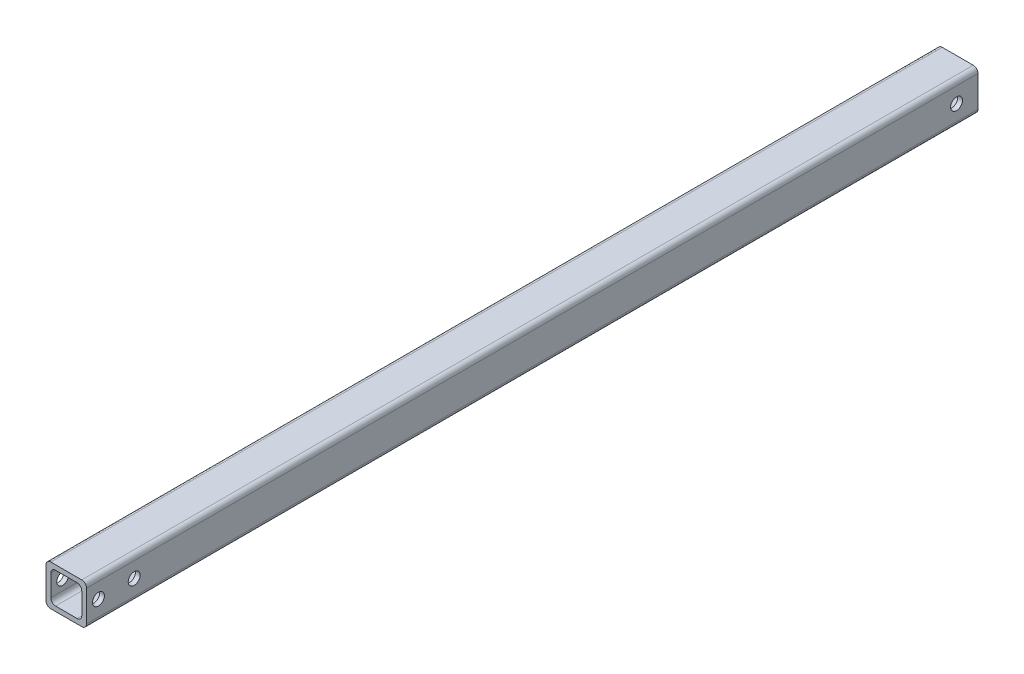
ISO-10303-21;
HEADER;
FILE_DESCRIPTION(('STEP AP214'),'2;1');
FILE_NAME('part.step','',(''),(''),'','','');
FILE_SCHEMA(('AUTOMOTIVE_DESIGN { 1 0 10303 214 1 1 1 1 }'));
ENDSEC;
DATA;
#1=APPLICATION_CONTEXT('core data for automotive mechanical design processes');
#2=APPLICATION_PROTOCOL_DEFINITION('international standard','automotive_design',2000,#1);
#3=PRODUCT_CONTEXT('',#1,'mechanical');
#4=PRODUCT('Part','Part','',(#3));
#5=PRODUCT_RELATED_PRODUCT_CATEGORY('part','',(#4));
#6=PRODUCT_DEFINITION_FORMATION('','',#4);
#7=PRODUCT_DEFINITION_CONTEXT('part definition',#1,'design');
#8=PRODUCT_DEFINITION('design','',#6,#7);
#9=PRODUCT_DEFINITION_SHAPE('','',#8);
#10=(LENGTH_UNIT() NAMED_UNIT(*) SI_UNIT(.MILLI.,.METRE.));
#11=(NAMED_UNIT(*) PLANE_ANGLE_UNIT() SI_UNIT($,.RADIAN.));
#12=(NAMED_UNIT(*) SI_UNIT($,.STERADIAN.) SOLID_ANGLE_UNIT());
#13=UNCERTAINTY_MEASURE_WITH_UNIT(LENGTH_MEASURE(1.E-05),#10,'distance_accuracy_value','');
#14=(GEOMETRIC_REPRESENTATION_CONTEXT(3) GLOBAL_UNCERTAINTY_ASSIGNED_CONTEXT((#13)) GLOBAL_UNIT_ASSIGNED_CONTEXT((#10,
#11,#12)) REPRESENTATION_CONTEXT('',''));
#15=CARTESIAN_POINT('',(0.,0.,0.));
#16=DIRECTION('',(0.,0.,1.));
#17=DIRECTION('',(1.,0.,0.));
#18=AXIS2_PLACEMENT_3D('',#15,#16,#17);
#19=CARTESIAN_POINT('',(-48.1349979691788,23.534639228473,374.));
#20=DIRECTION('',(1.,0.,0.));
#21=DIRECTION('',(0.,0.,-1.));
#22=AXIS2_PLACEMENT_3D('',#19,#20,#21);
#23=PLANE('',#22);
#24=CARTESIAN_POINT('',(-48.1349979691788,15.034639228473,9.));
#25=DIRECTION('',(1.,0.,0.));
#26=DIRECTION('',(0.,1.,0.));
#27=AXIS2_PLACEMENT_3D('',#24,#25,#26);
#28=CIRCLE('',#27,2.5);
#29=CARTESIAN_POINT('',(-48.1349979691788,17.534639228473,9.));
#30=VERTEX_POINT('',#29);
#31=EDGE_CURVE('E388',#30,#30,#28,.T.);
#32=ORIENTED_EDGE('',*,*,#31,.T.);
#33=EDGE_LOOP('',(#32));
#34=FACE_BOUND('',#33,.T.);
#35=CARTESIAN_POINT('',(-48.1349979691788,15.034639228473,354.));
#36=DIRECTION('',(1.,0.,0.));
#37=DIRECTION('',(0.,1.,0.));
#38=AXIS2_PLACEMENT_3D('',#35,#36,#37);
#39=CIRCLE('',#38,2.50000000000002);
#40=CARTESIAN_POINT('',(-48.1349979691788,17.5346392284731,354.));
#41=VERTEX_POINT('',#40);
#42=EDGE_CURVE('E251',#41,#41,#39,.T.);
#43=ORIENTED_EDGE('',*,*,#42,.T.);
#44=EDGE_LOOP('',(#43));
#45=FACE_BOUND('',#44,.T.);
#46=CARTESIAN_POINT('',(-48.1349979691788,15.034639228473,369.));
#47=DIRECTION('',(1.,0.,0.));
#48=DIRECTION('',(0.,1.,0.));
#49=AXIS2_PLACEMENT_3D('',#46,#47,#48);
#50=CIRCLE('',#49,2.50000000000002);
#51=CARTESIAN_POINT('',(-48.1349979691788,17.5346392284731,369.));
#52=VERTEX_POINT('',#51);
#53=EDGE_CURVE('E247',#52,#52,#50,.T.);
#54=ORIENTED_EDGE('',*,*,#53,.T.);
#55=EDGE_LOOP('',(#54));
#56=FACE_BOUND('',#55,.T.);
#57=DIRECTION('',(0.,-1.,0.));
#58=VECTOR('',#57,1.);
#59=CARTESIAN_POINT('',(-48.1349979691788,23.534639228473,0.));
#60=LINE('',#59,#58);
#61=CARTESIAN_POINT('',(-48.1349979691788,21.534639228473,0.));
#62=VERTEX_POINT('',#61);
#63=CARTESIAN_POINT('',(-48.1349979691788,8.53463922847303,0.));
#64=VERTEX_POINT('',#63);
#65=EDGE_CURVE('E173',#62,#64,#60,.T.);
#66=ORIENTED_EDGE('',*,*,#65,.T.);
#67=DIRECTION('',(0.,0.,-1.));
#68=VECTOR('',#67,1.);
#69=CARTESIAN_POINT('',(-48.1349979691788,8.53463922847303,374.));
#70=LINE('',#69,#68);
#71=CARTESIAN_POINT('',(-48.1349979691788,8.53463922847303,374.));
#72=VERTEX_POINT('',#71);
#73=EDGE_CURVE('E151',#64,#72,#70,.F.);
#74=ORIENTED_EDGE('',*,*,#73,.T.);
#75=DIRECTION('',(0.,-1.,0.));
#76=VECTOR('',#75,1.);
#77=CARTESIAN_POINT('',(-48.1349979691788,23.534639228473,374.));
#78=LINE('',#77,#76);
#79=CARTESIAN_POINT('',(-48.1349979691788,21.534639228473,374.));
#80=VERTEX_POINT('',#79);
#81=EDGE_CURVE('E184',#80,#72,#78,.T.);
#82=ORIENTED_EDGE('',*,*,#81,.F.);
#83=DIRECTION('',(0.,0.,-1.));
#84=VECTOR('',#83,1.);
#85=CARTESIAN_POINT('',(-48.1349979691788,21.534639228473,374.));
#86=LINE('',#85,#84);
#87=EDGE_CURVE('E156',#80,#62,#86,.T.);
#88=ORIENTED_EDGE('',*,*,#87,.T.);
#89=EDGE_LOOP('',(#66,#74,#82,#88));
#90=FACE_BOUND('',#89,.T.);
#91=ADVANCED_FACE('F31',(#34,#45,#56,#90),#23,.F.);
#92=CARTESIAN_POINT('',(-48.1349979691788,6.53463922847303,374.));
#93=DIRECTION('',(0.,1.,0.));
#94=DIRECTION('',(0.,0.,1.));
#95=AXIS2_PLACEMENT_3D('',#92,#93,#94);
#96=PLANE('',#95);
#97=DIRECTION('',(1.,0.,0.));
#98=VECTOR('',#97,1.);
#99=CARTESIAN_POINT('',(-48.1349979691788,6.53463922847303,374.));
#100=LINE('',#99,#98);
#101=CARTESIAN_POINT('',(-46.1349979691788,6.53463922847303,374.));
#102=VERTEX_POINT('',#101);
#103=CARTESIAN_POINT('',(-33.1349979691788,6.53463922847303,374.));
#104=VERTEX_POINT('',#103);
#105=EDGE_CURVE('E166',#102,#104,#100,.T.);
#106=ORIENTED_EDGE('',*,*,#105,.F.);
#107=DIRECTION('',(0.,0.,-1.));
#108=VECTOR('',#107,1.);
#109=CARTESIAN_POINT('',(-46.1349979691788,6.53463922847303,374.));
#110=LINE('',#109,#108);
#111=CARTESIAN_POINT('',(-46.1349979691788,6.53463922847303,0.));
#112=VERTEX_POINT('',#111);
#113=EDGE_CURVE('E150',#102,#112,#110,.T.);
#114=ORIENTED_EDGE('',*,*,#113,.T.);
#115=DIRECTION('',(1.,0.,0.));
#116=VECTOR('',#115,1.);
#117=CARTESIAN_POINT('',(-48.1349979691788,6.53463922847303,0.));
#118=LINE('',#117,#116);
#119=CARTESIAN_POINT('',(-33.1349979691788,6.53463922847303,0.));
#120=VERTEX_POINT('',#119);
#121=EDGE_CURVE('E163',#112,#120,#118,.T.);
#122=ORIENTED_EDGE('',*,*,#121,.T.);
#123=DIRECTION('',(0.,0.,-1.));
#124=VECTOR('',#123,1.);
#125=CARTESIAN_POINT('',(-33.1349979691788,6.53463922847303,374.));
#126=LINE('',#125,#124);
#127=EDGE_CURVE('E168',#120,#104,#126,.F.);
#128=ORIENTED_EDGE('',*,*,#127,.T.);
#129=EDGE_LOOP('',(#106,#114,#122,#128));
#130=FACE_BOUND('',#129,.T.);
#131=ADVANCED_FACE('F162',(#130),#96,.F.);
#132=CARTESIAN_POINT('',(-31.1349979691788,23.534639228473,374.));
#133=DIRECTION('',(-1.,0.,0.));
#134=DIRECTION('',(0.,-1.,0.));
#135=AXIS2_PLACEMENT_3D('',#132,#133,#134);
#136=PLANE('',#135);
#137=CARTESIAN_POINT('',(-31.1349979691788,15.034639228473,9.));
#138=DIRECTION('',(1.,0.,0.));
#139=DIRECTION('',(0.,1.,0.));
#140=AXIS2_PLACEMENT_3D('',#137,#138,#139);
#141=CIRCLE('',#140,2.5);
#142=CARTESIAN_POINT('',(-31.1349979691788,17.534639228473,9.));
#143=VERTEX_POINT('',#142);
#144=EDGE_CURVE('E393',#143,#143,#141,.T.);
#145=ORIENTED_EDGE('',*,*,#144,.F.);
#146=EDGE_LOOP('',(#145));
#147=FACE_BOUND('',#146,.T.);
#148=CARTESIAN_POINT('',(-31.1349979691788,15.034639228473,354.));
#149=DIRECTION('',(1.,0.,0.));
#150=DIRECTION('',(0.,1.,0.));
#151=AXIS2_PLACEMENT_3D('',#148,#149,#150);
#152=CIRCLE('',#151,2.50000000000002);
#153=CARTESIAN_POINT('',(-31.1349979691788,17.5346392284731,354.));
#154=VERTEX_POINT('',#153);
#155=EDGE_CURVE('E258',#154,#154,#152,.T.);
#156=ORIENTED_EDGE('',*,*,#155,.F.);
#157=EDGE_LOOP('',(#156));
#158=FACE_BOUND('',#157,.T.);
#159=CARTESIAN_POINT('',(-31.1349979691788,15.034639228473,369.));
#160=DIRECTION('',(1.,0.,0.));
#161=DIRECTION('',(0.,1.,0.));
#162=AXIS2_PLACEMENT_3D('',#159,#160,#161);
#163=CIRCLE('',#162,2.50000000000002);
#164=CARTESIAN_POINT('',(-31.1349979691788,17.5346392284731,369.));
#165=VERTEX_POINT('',#164);
#166=EDGE_CURVE('E255',#165,#165,#163,.T.);
#167=ORIENTED_EDGE('',*,*,#166,.F.);
#168=EDGE_LOOP('',(#167));
#169=FACE_BOUND('',#168,.T.);
#170=DIRECTION('',(0.,1.,0.));
#171=VECTOR('',#170,1.);
#172=CARTESIAN_POINT('',(-31.1349979691788,23.534639228473,374.));
#173=LINE('',#172,#171);
#174=CARTESIAN_POINT('',(-31.1349979691788,8.53463922847303,374.));
#175=VERTEX_POINT('',#174);
#176=CARTESIAN_POINT('',(-31.1349979691788,21.534639228473,374.));
#177=VERTEX_POINT('',#176);
#178=EDGE_CURVE('E297',#175,#177,#173,.T.);
#179=ORIENTED_EDGE('',*,*,#178,.F.);
#180=DIRECTION('',(0.,0.,-1.));
#181=VECTOR('',#180,1.);
#182=CARTESIAN_POINT('',(-31.1349979691788,8.53463922847303,374.));
#183=LINE('',#182,#181);
#184=CARTESIAN_POINT('',(-31.1349979691788,8.53463922847303,0.));
#185=VERTEX_POINT('',#184);
#186=EDGE_CURVE('E204',#175,#185,#183,.T.);
#187=ORIENTED_EDGE('',*,*,#186,.T.);
#188=DIRECTION('',(0.,1.,0.));
#189=VECTOR('',#188,1.);
#190=CARTESIAN_POINT('',(-31.1349979691788,23.534639228473,0.));
#191=LINE('',#190,#189);
#192=CARTESIAN_POINT('',(-31.1349979691788,21.534639228473,0.));
#193=VERTEX_POINT('',#192);
#194=EDGE_CURVE('E172',#185,#193,#191,.T.);
#195=ORIENTED_EDGE('',*,*,#194,.T.);
#196=DIRECTION('',(0.,0.,-1.));
#197=VECTOR('',#196,1.);
#198=CARTESIAN_POINT('',(-31.1349979691788,21.534639228473,374.));
#199=LINE('',#198,#197);
#200=EDGE_CURVE('E202',#193,#177,#199,.F.);
#201=ORIENTED_EDGE('',*,*,#200,.T.);
#202=EDGE_LOOP('',(#179,#187,#195,#201));
#203=FACE_BOUND('',#202,.T.);
#204=ADVANCED_FACE('F320',(#147,#158,#169,#203),#136,.F.);
#205=CARTESIAN_POINT('',(-48.1349979691788,23.534639228473,374.));
#206=DIRECTION('',(0.,-1.,0.));
#207=DIRECTION('',(0.,0.,-1.));
#208=AXIS2_PLACEMENT_3D('',#205,#206,#207);
#209=PLANE('',#208);
#210=DIRECTION('',(-1.,0.,0.));
#211=VECTOR('',#210,1.);
#212=CARTESIAN_POINT('',(-48.1349979691788,23.534639228473,0.));
#213=LINE('',#212,#211);
#214=CARTESIAN_POINT('',(-33.1349979691788,23.534639228473,0.));
#215=VERTEX_POINT('',#214);
#216=CARTESIAN_POINT('',(-46.1349979691788,23.534639228473,0.));
#217=VERTEX_POINT('',#216);
#218=EDGE_CURVE('E176',#215,#217,#213,.T.);
#219=ORIENTED_EDGE('',*,*,#218,.T.);
#220=DIRECTION('',(0.,0.,-1.));
#221=VECTOR('',#220,1.);
#222=CARTESIAN_POINT('',(-46.1349979691788,23.534639228473,374.));
#223=LINE('',#222,#221);
#224=CARTESIAN_POINT('',(-46.1349979691788,23.534639228473,374.));
#225=VERTEX_POINT('',#224);
#226=EDGE_CURVE('E210',#217,#225,#223,.F.);
#227=ORIENTED_EDGE('',*,*,#226,.T.);
#228=DIRECTION('',(-1.,0.,0.));
#229=VECTOR('',#228,1.);
#230=CARTESIAN_POINT('',(-48.1349979691788,23.534639228473,374.));
#231=LINE('',#230,#229);
#232=CARTESIAN_POINT('',(-33.1349979691788,23.534639228473,374.));
#233=VERTEX_POINT('',#232);
#234=EDGE_CURVE('E185',#233,#225,#231,.T.);
#235=ORIENTED_EDGE('',*,*,#234,.F.);
#236=DIRECTION('',(0.,0.,-1.));
#237=VECTOR('',#236,1.);
#238=CARTESIAN_POINT('',(-33.1349979691788,23.534639228473,374.));
#239=LINE('',#238,#237);
#240=EDGE_CURVE('E207',#233,#215,#239,.T.);
#241=ORIENTED_EDGE('',*,*,#240,.T.);
#242=EDGE_LOOP('',(#219,#227,#235,#241));
#243=FACE_BOUND('',#242,.T.);
#244=ADVANCED_FACE('F314',(#243),#209,.F.);
#245=CARTESIAN_POINT('',(-48.1349979691788,6.53463922847303,374.));
#246=DIRECTION('',(0.,0.,1.));
#247=DIRECTION('',(1.,0.,0.));
#248=AXIS2_PLACEMENT_3D('',#245,#246,#247);
#249=PLANE('',#248);
#250=DIRECTION('',(0.,-1.,0.));
#251=VECTOR('',#250,1.);
#252=CARTESIAN_POINT('',(-46.1349979691788,21.534639228473,374.));
#253=LINE('',#252,#251);
#254=CARTESIAN_POINT('',(-46.1349979691788,19.534639228473,374.));
#255=VERTEX_POINT('',#254);
#256=CARTESIAN_POINT('',(-46.1349979691788,10.534639228473,374.));
#257=VERTEX_POINT('',#256);
#258=EDGE_CURVE('E274',#255,#257,#253,.T.);
#259=ORIENTED_EDGE('',*,*,#258,.F.);
#260=CARTESIAN_POINT('',(-44.1349979691788,19.534639228473,374.));
#261=DIRECTION('',(0.,0.,1.));
#262=DIRECTION('',(1.,0.,0.));
#263=AXIS2_PLACEMENT_3D('',#260,#261,#262);
#264=CIRCLE('',#263,2.);
#265=CARTESIAN_POINT('',(-44.1349979691788,21.534639228473,374.));
#266=VERTEX_POINT('',#265);
#267=EDGE_CURVE('E239',#255,#266,#264,.F.);
#268=ORIENTED_EDGE('',*,*,#267,.T.);
#269=DIRECTION('',(-1.,0.,0.));
#270=VECTOR('',#269,1.);
#271=CARTESIAN_POINT('',(-46.1349979691788,21.534639228473,374.));
#272=LINE('',#271,#270);
#273=CARTESIAN_POINT('',(-35.1349979691788,21.534639228473,374.));
#274=VERTEX_POINT('',#273);
#275=EDGE_CURVE('E279',#274,#266,#272,.T.);
#276=ORIENTED_EDGE('',*,*,#275,.F.);
#277=CARTESIAN_POINT('',(-35.1349979691788,19.534639228473,374.));
#278=DIRECTION('',(0.,0.,1.));
#279=DIRECTION('',(1.,0.,0.));
#280=AXIS2_PLACEMENT_3D('',#277,#278,#279);
#281=CIRCLE('',#280,2.);
#282=CARTESIAN_POINT('',(-33.1349979691788,19.534639228473,374.));
#283=VERTEX_POINT('',#282);
#284=EDGE_CURVE('E40',#274,#283,#281,.F.);
#285=ORIENTED_EDGE('',*,*,#284,.T.);
#286=DIRECTION('',(0.,1.,0.));
#287=VECTOR('',#286,1.);
#288=CARTESIAN_POINT('',(-33.1349979691788,21.534639228473,374.));
#289=LINE('',#288,#287);
#290=CARTESIAN_POINT('',(-33.1349979691788,10.534639228473,374.));
#291=VERTEX_POINT('',#290);
#292=EDGE_CURVE('E290',#291,#283,#289,.T.);
#293=ORIENTED_EDGE('',*,*,#292,.F.);
#294=CARTESIAN_POINT('',(-35.1349979691788,10.534639228473,374.));
#295=DIRECTION('',(0.,0.,1.));
#296=DIRECTION('',(1.,0.,0.));
#297=AXIS2_PLACEMENT_3D('',#294,#295,#296);
#298=CIRCLE('',#297,2.);
#299=CARTESIAN_POINT('',(-35.1349979691788,8.53463922847303,374.));
#300=VERTEX_POINT('',#299);
#301=EDGE_CURVE('E231',#291,#300,#298,.F.);
#302=ORIENTED_EDGE('',*,*,#301,.T.);
#303=DIRECTION('',(1.,0.,0.));
#304=VECTOR('',#303,1.);
#305=CARTESIAN_POINT('',(-46.1349979691788,8.53463922847303,374.));
#306=LINE('',#305,#304);
#307=CARTESIAN_POINT('',(-44.1349979691788,8.53463922847303,374.));
#308=VERTEX_POINT('',#307);
#309=EDGE_CURVE('E287',#308,#300,#306,.T.);
#310=ORIENTED_EDGE('',*,*,#309,.F.);
#311=CARTESIAN_POINT('',(-44.1349979691788,10.534639228473,374.));
#312=DIRECTION('',(0.,0.,1.));
#313=DIRECTION('',(1.,0.,0.));
#314=AXIS2_PLACEMENT_3D('',#311,#312,#313);
#315=CIRCLE('',#314,2.);
#316=EDGE_CURVE('E235',#308,#257,#315,.F.);
#317=ORIENTED_EDGE('',*,*,#316,.T.);
#318=EDGE_LOOP('',(#259,#268,#276,#285,#293,#302,#310,#317));
#319=FACE_BOUND('',#318,.T.);
#320=ORIENTED_EDGE('',*,*,#81,.T.);
#321=CARTESIAN_POINT('',(-46.1349979691788,8.53463922847303,374.));
#322=DIRECTION('',(0.,0.,1.));
#323=DIRECTION('',(1.,0.,0.));
#324=AXIS2_PLACEMENT_3D('',#321,#322,#323);
#325=CIRCLE('',#324,2.);
#326=EDGE_CURVE('E200',#72,#102,#325,.T.);
#327=ORIENTED_EDGE('',*,*,#326,.T.);
#328=ORIENTED_EDGE('',*,*,#105,.T.);
#329=CARTESIAN_POINT('',(-33.1349979691788,8.53463922847303,374.));
#330=DIRECTION('',(0.,0.,1.));
#331=DIRECTION('',(1.,0.,0.));
#332=AXIS2_PLACEMENT_3D('',#329,#330,#331);
#333=CIRCLE('',#332,2.);
#334=EDGE_CURVE('E198',#104,#175,#333,.T.);
#335=ORIENTED_EDGE('',*,*,#334,.T.);
#336=ORIENTED_EDGE('',*,*,#178,.T.);
#337=CARTESIAN_POINT('',(-33.1349979691788,21.534639228473,374.));
#338=DIRECTION('',(0.,0.,1.));
#339=DIRECTION('',(1.,0.,0.));
#340=AXIS2_PLACEMENT_3D('',#337,#338,#339);
#341=CIRCLE('',#340,2.);
#342=EDGE_CURVE('E194',#177,#233,#341,.T.);
#343=ORIENTED_EDGE('',*,*,#342,.T.);
#344=ORIENTED_EDGE('',*,*,#234,.T.);
#345=CARTESIAN_POINT('',(-46.1349979691788,21.534639228473,374.));
#346=DIRECTION('',(0.,0.,1.));
#347=DIRECTION('',(1.,0.,0.));
#348=AXIS2_PLACEMENT_3D('',#345,#346,#347);
#349=CIRCLE('',#348,2.);
#350=EDGE_CURVE('E196',#225,#80,#349,.T.);
#351=ORIENTED_EDGE('',*,*,#350,.T.);
#352=EDGE_LOOP('',(#320,#327,#328,#335,#336,#343,#344,#351));
#353=FACE_BOUND('',#352,.T.);
#354=ADVANCED_FACE('F303',(#319,#353),#249,.T.);
#355=CARTESIAN_POINT('',(-48.1349979691788,6.53463922847303,0.));
#356=DIRECTION('',(0.,0.,1.));
#357=DIRECTION('',(1.,0.,0.));
#358=AXIS2_PLACEMENT_3D('',#355,#356,#357);
#359=PLANE('',#358);
#360=DIRECTION('',(0.,1.,0.));
#361=VECTOR('',#360,1.);
#362=CARTESIAN_POINT('',(-33.1349979691788,21.534639228473,0.));
#363=LINE('',#362,#361);
#364=CARTESIAN_POINT('',(-33.1349979691788,10.534639228473,0.));
#365=VERTEX_POINT('',#364);
#366=CARTESIAN_POINT('',(-33.1349979691788,19.534639228473,0.));
#367=VERTEX_POINT('',#366);
#368=EDGE_CURVE('E282',#365,#367,#363,.T.);
#369=ORIENTED_EDGE('',*,*,#368,.T.);
#370=CARTESIAN_POINT('',(-35.1349979691788,19.534639228473,0.));
#371=DIRECTION('',(0.,0.,1.));
#372=DIRECTION('',(1.,0.,0.));
#373=AXIS2_PLACEMENT_3D('',#370,#371,#372);
#374=CIRCLE('',#373,2.);
#375=CARTESIAN_POINT('',(-35.1349979691788,21.534639228473,0.));
#376=VERTEX_POINT('',#375);
#377=EDGE_CURVE('E11',#367,#376,#374,.T.);
#378=ORIENTED_EDGE('',*,*,#377,.T.);
#379=DIRECTION('',(-1.,0.,0.));
#380=VECTOR('',#379,1.);
#381=CARTESIAN_POINT('',(-46.1349979691788,21.534639228473,0.));
#382=LINE('',#381,#380);
#383=CARTESIAN_POINT('',(-44.1349979691788,21.534639228473,0.));
#384=VERTEX_POINT('',#383);
#385=EDGE_CURVE('E178',#376,#384,#382,.T.);
#386=ORIENTED_EDGE('',*,*,#385,.T.);
#387=CARTESIAN_POINT('',(-44.1349979691788,19.534639228473,0.));
#388=DIRECTION('',(0.,0.,1.));
#389=DIRECTION('',(1.,0.,0.));
#390=AXIS2_PLACEMENT_3D('',#387,#388,#389);
#391=CIRCLE('',#390,2.);
#392=CARTESIAN_POINT('',(-46.1349979691788,19.534639228473,0.));
#393=VERTEX_POINT('',#392);
#394=EDGE_CURVE('E241',#384,#393,#391,.T.);
#395=ORIENTED_EDGE('',*,*,#394,.T.);
#396=DIRECTION('',(0.,-1.,0.));
#397=VECTOR('',#396,1.);
#398=CARTESIAN_POINT('',(-46.1349979691788,21.534639228473,0.));
#399=LINE('',#398,#397);
#400=CARTESIAN_POINT('',(-46.1349979691788,10.534639228473,0.));
#401=VERTEX_POINT('',#400);
#402=EDGE_CURVE('E275',#393,#401,#399,.T.);
#403=ORIENTED_EDGE('',*,*,#402,.T.);
#404=CARTESIAN_POINT('',(-44.1349979691788,10.534639228473,0.));
#405=DIRECTION('',(0.,0.,1.));
#406=DIRECTION('',(1.,0.,0.));
#407=AXIS2_PLACEMENT_3D('',#404,#405,#406);
#408=CIRCLE('',#407,2.);
#409=CARTESIAN_POINT('',(-44.1349979691788,8.53463922847303,0.));
#410=VERTEX_POINT('',#409);
#411=EDGE_CURVE('E237',#401,#410,#408,.T.);
#412=ORIENTED_EDGE('',*,*,#411,.T.);
#413=DIRECTION('',(1.,0.,0.));
#414=VECTOR('',#413,1.);
#415=CARTESIAN_POINT('',(-46.1349979691788,8.53463922847303,0.));
#416=LINE('',#415,#414);
#417=CARTESIAN_POINT('',(-35.1349979691788,8.53463922847303,0.));
#418=VERTEX_POINT('',#417);
#419=EDGE_CURVE('E278',#410,#418,#416,.T.);
#420=ORIENTED_EDGE('',*,*,#419,.T.);
#421=CARTESIAN_POINT('',(-35.1349979691788,10.534639228473,0.));
#422=DIRECTION('',(0.,0.,1.));
#423=DIRECTION('',(1.,0.,0.));
#424=AXIS2_PLACEMENT_3D('',#421,#422,#423);
#425=CIRCLE('',#424,2.);
#426=EDGE_CURVE('E233',#418,#365,#425,.T.);
#427=ORIENTED_EDGE('',*,*,#426,.T.);
#428=EDGE_LOOP('',(#369,#378,#386,#395,#403,#412,#420,#427));
#429=FACE_BOUND('',#428,.T.);
#430=ORIENTED_EDGE('',*,*,#121,.F.);
#431=CARTESIAN_POINT('',(-46.1349979691788,8.53463922847303,0.));
#432=DIRECTION('',(0.,0.,1.));
#433=DIRECTION('',(1.,0.,0.));
#434=AXIS2_PLACEMENT_3D('',#431,#432,#433);
#435=CIRCLE('',#434,2.);
#436=EDGE_CURVE('E146',#112,#64,#435,.F.);
#437=ORIENTED_EDGE('',*,*,#436,.T.);
#438=ORIENTED_EDGE('',*,*,#65,.F.);
#439=CARTESIAN_POINT('',(-46.1349979691788,21.534639228473,0.));
#440=DIRECTION('',(0.,0.,1.));
#441=DIRECTION('',(1.,0.,0.));
#442=AXIS2_PLACEMENT_3D('',#439,#440,#441);
#443=CIRCLE('',#442,2.);
#444=EDGE_CURVE('E188',#62,#217,#443,.F.);
#445=ORIENTED_EDGE('',*,*,#444,.T.);
#446=ORIENTED_EDGE('',*,*,#218,.F.);
#447=CARTESIAN_POINT('',(-33.1349979691788,21.534639228473,0.));
#448=DIRECTION('',(0.,0.,1.));
#449=DIRECTION('',(1.,0.,0.));
#450=AXIS2_PLACEMENT_3D('',#447,#448,#449);
#451=CIRCLE('',#450,2.);
#452=EDGE_CURVE('E167',#215,#193,#451,.F.);
#453=ORIENTED_EDGE('',*,*,#452,.T.);
#454=ORIENTED_EDGE('',*,*,#194,.F.);
#455=CARTESIAN_POINT('',(-33.1349979691788,8.53463922847303,0.));
#456=DIRECTION('',(0.,0.,1.));
#457=DIRECTION('',(1.,0.,0.));
#458=AXIS2_PLACEMENT_3D('',#455,#456,#457);
#459=CIRCLE('',#458,2.);
#460=EDGE_CURVE('E157',#185,#120,#459,.F.);
#461=ORIENTED_EDGE('',*,*,#460,.T.);
#462=EDGE_LOOP('',(#430,#437,#438,#445,#446,#453,#454,#461));
#463=FACE_BOUND('',#462,.T.);
#464=ADVANCED_FACE('F170',(#429,#463),#359,.F.);
#465=CARTESIAN_POINT('',(-46.1349979691788,8.53463922847303,374.));
#466=DIRECTION('',(0.,0.,-1.));
#467=DIRECTION('',(-1.,0.,0.));
#468=AXIS2_PLACEMENT_3D('',#465,#466,#467);
#469=CYLINDRICAL_SURFACE('',#468,2.);
#470=ORIENTED_EDGE('',*,*,#326,.F.);
#471=ORIENTED_EDGE('',*,*,#73,.F.);
#472=ORIENTED_EDGE('',*,*,#436,.F.);
#473=ORIENTED_EDGE('',*,*,#113,.F.);
#474=EDGE_LOOP('',(#470,#471,#472,#473));
#475=FACE_BOUND('',#474,.T.);
#476=ADVANCED_FACE('F149',(#475),#469,.T.);
#477=CARTESIAN_POINT('',(-33.1349979691788,8.53463922847303,374.));
#478=DIRECTION('',(0.,0.,-1.));
#479=DIRECTION('',(-1.,0.,0.));
#480=AXIS2_PLACEMENT_3D('',#477,#478,#479);
#481=CYLINDRICAL_SURFACE('',#480,2.);
#482=ORIENTED_EDGE('',*,*,#334,.F.);
#483=ORIENTED_EDGE('',*,*,#127,.F.);
#484=ORIENTED_EDGE('',*,*,#460,.F.);
#485=ORIENTED_EDGE('',*,*,#186,.F.);
#486=EDGE_LOOP('',(#482,#483,#484,#485));
#487=FACE_BOUND('',#486,.T.);
#488=ADVANCED_FACE('F324',(#487),#481,.T.);
#489=CARTESIAN_POINT('',(-46.1349979691788,21.534639228473,374.));
#490=DIRECTION('',(0.,0.,-1.));
#491=DIRECTION('',(-1.,0.,0.));
#492=AXIS2_PLACEMENT_3D('',#489,#490,#491);
#493=CYLINDRICAL_SURFACE('',#492,2.);
#494=ORIENTED_EDGE('',*,*,#350,.F.);
#495=ORIENTED_EDGE('',*,*,#226,.F.);
#496=ORIENTED_EDGE('',*,*,#444,.F.);
#497=ORIENTED_EDGE('',*,*,#87,.F.);
#498=EDGE_LOOP('',(#494,#495,#496,#497));
#499=FACE_BOUND('',#498,.T.);
#500=ADVANCED_FACE('F311',(#499),#493,.T.);
#501=CARTESIAN_POINT('',(-33.1349979691788,21.534639228473,374.));
#502=DIRECTION('',(0.,0.,-1.));
#503=DIRECTION('',(-1.,0.,0.));
#504=AXIS2_PLACEMENT_3D('',#501,#502,#503);
#505=CYLINDRICAL_SURFACE('',#504,2.);
#506=ORIENTED_EDGE('',*,*,#342,.F.);
#507=ORIENTED_EDGE('',*,*,#200,.F.);
#508=ORIENTED_EDGE('',*,*,#452,.F.);
#509=ORIENTED_EDGE('',*,*,#240,.F.);
#510=EDGE_LOOP('',(#506,#507,#508,#509));
#511=FACE_BOUND('',#510,.T.);
#512=ADVANCED_FACE('F316',(#511),#505,.T.);
#513=CARTESIAN_POINT('',(-46.1349979691788,21.534639228473,0.));
#514=DIRECTION('',(-1.,0.,0.));
#515=DIRECTION('',(0.,-1.,0.));
#516=AXIS2_PLACEMENT_3D('',#513,#514,#515);
#517=PLANE('',#516);
#518=CARTESIAN_POINT('',(-46.1349979691788,15.034639228473,9.));
#519=DIRECTION('',(-1.,0.,0.));
#520=DIRECTION('',(0.,-1.,0.));
#521=AXIS2_PLACEMENT_3D('',#518,#519,#520);
#522=CIRCLE('',#521,2.5);
#523=CARTESIAN_POINT('',(-46.1349979691788,12.534639228473,9.));
#524=VERTEX_POINT('',#523);
#525=EDGE_CURVE('E263',#524,#524,#522,.T.);
#526=ORIENTED_EDGE('',*,*,#525,.T.);
#527=EDGE_LOOP('',(#526));
#528=FACE_BOUND('',#527,.T.);
#529=CARTESIAN_POINT('',(-46.1349979691788,15.034639228473,354.));
#530=DIRECTION('',(-1.,0.,0.));
#531=DIRECTION('',(0.,-1.,0.));
#532=AXIS2_PLACEMENT_3D('',#529,#530,#531);
#533=CIRCLE('',#532,2.50000000000002);
#534=CARTESIAN_POINT('',(-46.1349979691788,12.534639228473,354.));
#535=VERTEX_POINT('',#534);
#536=EDGE_CURVE('E250',#535,#535,#533,.T.);
#537=ORIENTED_EDGE('',*,*,#536,.T.);
#538=EDGE_LOOP('',(#537));
#539=FACE_BOUND('',#538,.T.);
#540=CARTESIAN_POINT('',(-46.1349979691788,15.034639228473,369.));
#541=DIRECTION('',(-1.,0.,0.));
#542=DIRECTION('',(0.,-1.,0.));
#543=AXIS2_PLACEMENT_3D('',#540,#541,#542);
#544=CIRCLE('',#543,2.50000000000002);
#545=CARTESIAN_POINT('',(-46.1349979691788,12.534639228473,369.));
#546=VERTEX_POINT('',#545);
#547=EDGE_CURVE('E246',#546,#546,#544,.T.);
#548=ORIENTED_EDGE('',*,*,#547,.T.);
#549=EDGE_LOOP('',(#548));
#550=FACE_BOUND('',#549,.T.);
#551=ORIENTED_EDGE('',*,*,#258,.T.);
#552=DIRECTION('',(0.,0.,1.));
#553=VECTOR('',#552,1.);
#554=CARTESIAN_POINT('',(-46.1349979691788,10.534639228473,0.));
#555=LINE('',#554,#553);
#556=EDGE_CURVE('E225',#257,#401,#555,.F.);
#557=ORIENTED_EDGE('',*,*,#556,.T.);
#558=ORIENTED_EDGE('',*,*,#402,.F.);
#559=DIRECTION('',(0.,0.,1.));
#560=VECTOR('',#559,1.);
#561=CARTESIAN_POINT('',(-46.1349979691788,19.534639228473,374.));
#562=LINE('',#561,#560);
#563=EDGE_CURVE('E222',#393,#255,#562,.T.);
#564=ORIENTED_EDGE('',*,*,#563,.T.);
#565=EDGE_LOOP('',(#551,#557,#558,#564));
#566=FACE_BOUND('',#565,.T.);
#567=ADVANCED_FACE('F352',(#528,#539,#550,#566),#517,.F.);
#568=CARTESIAN_POINT('',(-46.1349979691788,21.534639228473,0.));
#569=DIRECTION('',(0.,1.,0.));
#570=DIRECTION('',(-1.,0.,0.));
#571=AXIS2_PLACEMENT_3D('',#568,#569,#570);
#572=PLANE('',#571);
#573=ORIENTED_EDGE('',*,*,#275,.T.);
#574=DIRECTION('',(0.,0.,1.));
#575=VECTOR('',#574,1.);
#576=CARTESIAN_POINT('',(-44.1349979691788,21.534639228473,0.));
#577=LINE('',#576,#575);
#578=EDGE_CURVE('E48',#266,#384,#577,.F.);
#579=ORIENTED_EDGE('',*,*,#578,.T.);
#580=ORIENTED_EDGE('',*,*,#385,.F.);
#581=DIRECTION('',(0.,0.,1.));
#582=VECTOR('',#581,1.);
#583=CARTESIAN_POINT('',(-35.1349979691788,21.534639228473,374.));
#584=LINE('',#583,#582);
#585=EDGE_CURVE('E227',#376,#274,#584,.T.);
#586=ORIENTED_EDGE('',*,*,#585,.T.);
#587=EDGE_LOOP('',(#573,#579,#580,#586));
#588=FACE_BOUND('',#587,.T.);
#589=ADVANCED_FACE('F355',(#588),#572,.F.);
#590=CARTESIAN_POINT('',(-33.1349979691788,21.534639228473,0.));
#591=DIRECTION('',(1.,0.,0.));
#592=DIRECTION('',(0.,0.,-1.));
#593=AXIS2_PLACEMENT_3D('',#590,#591,#592);
#594=PLANE('',#593);
#595=CARTESIAN_POINT('',(-33.1349979691788,15.034639228473,9.));
#596=DIRECTION('',(1.,0.,0.));
#597=DIRECTION('',(0.,0.,-1.));
#598=AXIS2_PLACEMENT_3D('',#595,#596,#597);
#599=CIRCLE('',#598,2.5);
#600=CARTESIAN_POINT('',(-33.1349979691788,15.034639228473,6.5));
#601=VERTEX_POINT('',#600);
#602=EDGE_CURVE('E35',#601,#601,#599,.T.);
#603=ORIENTED_EDGE('',*,*,#602,.T.);
#604=EDGE_LOOP('',(#603));
#605=FACE_BOUND('',#604,.T.);
#606=CARTESIAN_POINT('',(-33.1349979691788,15.034639228473,354.));
#607=DIRECTION('',(1.,0.,0.));
#608=DIRECTION('',(0.,0.,-1.));
#609=AXIS2_PLACEMENT_3D('',#606,#607,#608);
#610=CIRCLE('',#609,2.50000000000002);
#611=CARTESIAN_POINT('',(-33.1349979691788,15.034639228473,351.5));
#612=VERTEX_POINT('',#611);
#613=EDGE_CURVE('E248',#612,#612,#610,.T.);
#614=ORIENTED_EDGE('',*,*,#613,.T.);
#615=EDGE_LOOP('',(#614));
#616=FACE_BOUND('',#615,.T.);
#617=CARTESIAN_POINT('',(-33.1349979691788,15.034639228473,369.));
#618=DIRECTION('',(1.,0.,0.));
#619=DIRECTION('',(0.,0.,-1.));
#620=AXIS2_PLACEMENT_3D('',#617,#618,#619);
#621=CIRCLE('',#620,2.50000000000002);
#622=CARTESIAN_POINT('',(-33.1349979691788,15.034639228473,366.5));
#623=VERTEX_POINT('',#622);
#624=EDGE_CURVE('E244',#623,#623,#621,.T.);
#625=ORIENTED_EDGE('',*,*,#624,.T.);
#626=EDGE_LOOP('',(#625));
#627=FACE_BOUND('',#626,.T.);
#628=ORIENTED_EDGE('',*,*,#368,.F.);
#629=DIRECTION('',(0.,0.,1.));
#630=VECTOR('',#629,1.);
#631=CARTESIAN_POINT('',(-33.1349979691788,10.534639228473,374.));
#632=LINE('',#631,#630);
#633=EDGE_CURVE('E214',#365,#291,#632,.T.);
#634=ORIENTED_EDGE('',*,*,#633,.T.);
#635=ORIENTED_EDGE('',*,*,#292,.T.);
#636=DIRECTION('',(0.,0.,1.));
#637=VECTOR('',#636,1.);
#638=CARTESIAN_POINT('',(-33.1349979691788,19.534639228473,0.));
#639=LINE('',#638,#637);
#640=EDGE_CURVE('E212',#283,#367,#639,.F.);
#641=ORIENTED_EDGE('',*,*,#640,.T.);
#642=EDGE_LOOP('',(#628,#634,#635,#641));
#643=FACE_BOUND('',#642,.T.);
#644=ADVANCED_FACE('F361',(#605,#616,#627,#643),#594,.F.);
#645=CARTESIAN_POINT('',(-46.1349979691788,8.53463922847303,0.));
#646=DIRECTION('',(0.,-1.,0.));
#647=DIRECTION('',(0.,0.,-1.));
#648=AXIS2_PLACEMENT_3D('',#645,#646,#647);
#649=PLANE('',#648);
#650=ORIENTED_EDGE('',*,*,#309,.T.);
#651=DIRECTION('',(0.,0.,1.));
#652=VECTOR('',#651,1.);
#653=CARTESIAN_POINT('',(-35.1349979691788,8.53463922847303,0.));
#654=LINE('',#653,#652);
#655=EDGE_CURVE('E220',#300,#418,#654,.F.);
#656=ORIENTED_EDGE('',*,*,#655,.T.);
#657=ORIENTED_EDGE('',*,*,#419,.F.);
#658=DIRECTION('',(0.,0.,1.));
#659=VECTOR('',#658,1.);
#660=CARTESIAN_POINT('',(-44.1349979691788,8.53463922847303,374.));
#661=LINE('',#660,#659);
#662=EDGE_CURVE('E217',#410,#308,#661,.T.);
#663=ORIENTED_EDGE('',*,*,#662,.T.);
#664=EDGE_LOOP('',(#650,#656,#657,#663));
#665=FACE_BOUND('',#664,.T.);
#666=ADVANCED_FACE('F357',(#665),#649,.F.);
#667=CARTESIAN_POINT('',(-35.1349979691788,10.534639228473,0.));
#668=DIRECTION('',(0.,0.,-1.));
#669=DIRECTION('',(-1.,0.,0.));
#670=AXIS2_PLACEMENT_3D('',#667,#668,#669);
#671=CYLINDRICAL_SURFACE('',#670,2.);
#672=ORIENTED_EDGE('',*,*,#426,.F.);
#673=ORIENTED_EDGE('',*,*,#655,.F.);
#674=ORIENTED_EDGE('',*,*,#301,.F.);
#675=ORIENTED_EDGE('',*,*,#633,.F.);
#676=EDGE_LOOP('',(#672,#673,#674,#675));
#677=FACE_BOUND('',#676,.T.);
#678=ADVANCED_FACE('F360',(#677),#671,.F.);
#679=CARTESIAN_POINT('',(-44.1349979691788,10.534639228473,0.));
#680=DIRECTION('',(0.,0.,-1.));
#681=DIRECTION('',(-1.,0.,0.));
#682=AXIS2_PLACEMENT_3D('',#679,#680,#681);
#683=CYLINDRICAL_SURFACE('',#682,2.);
#684=ORIENTED_EDGE('',*,*,#411,.F.);
#685=ORIENTED_EDGE('',*,*,#556,.F.);
#686=ORIENTED_EDGE('',*,*,#316,.F.);
#687=ORIENTED_EDGE('',*,*,#662,.F.);
#688=EDGE_LOOP('',(#684,#685,#686,#687));
#689=FACE_BOUND('',#688,.T.);
#690=ADVANCED_FACE('F421',(#689),#683,.F.);
#691=CARTESIAN_POINT('',(-44.1349979691788,19.534639228473,0.));
#692=DIRECTION('',(0.,0.,-1.));
#693=DIRECTION('',(-1.,0.,0.));
#694=AXIS2_PLACEMENT_3D('',#691,#692,#693);
#695=CYLINDRICAL_SURFACE('',#694,2.);
#696=ORIENTED_EDGE('',*,*,#394,.F.);
#697=ORIENTED_EDGE('',*,*,#578,.F.);
#698=ORIENTED_EDGE('',*,*,#267,.F.);
#699=ORIENTED_EDGE('',*,*,#563,.F.);
#700=EDGE_LOOP('',(#696,#697,#698,#699));
#701=FACE_BOUND('',#700,.T.);
#702=ADVANCED_FACE('F428',(#701),#695,.F.);
#703=CARTESIAN_POINT('',(-35.1349979691788,19.534639228473,0.));
#704=DIRECTION('',(0.,0.,-1.));
#705=DIRECTION('',(-1.,0.,0.));
#706=AXIS2_PLACEMENT_3D('',#703,#704,#705);
#707=CYLINDRICAL_SURFACE('',#706,2.);
#708=ORIENTED_EDGE('',*,*,#377,.F.);
#709=ORIENTED_EDGE('',*,*,#640,.F.);
#710=ORIENTED_EDGE('',*,*,#284,.F.);
#711=ORIENTED_EDGE('',*,*,#585,.F.);
#712=EDGE_LOOP('',(#708,#709,#710,#711));
#713=FACE_BOUND('',#712,.T.);
#714=ADVANCED_FACE('F33',(#713),#707,.F.);
#715=CARTESIAN_POINT('',(-48.1349979691788,15.034639228473,369.));
#716=DIRECTION('',(1.,0.,0.));
#717=DIRECTION('',(0.,1.,0.));
#718=AXIS2_PLACEMENT_3D('',#715,#716,#717);
#719=CYLINDRICAL_SURFACE('',#718,2.50000000000002);
#720=ORIENTED_EDGE('',*,*,#166,.T.);
#721=EDGE_LOOP('',(#720));
#722=FACE_BOUND('',#721,.T.);
#723=ORIENTED_EDGE('',*,*,#624,.F.);
#724=EDGE_LOOP('',(#723));
#725=FACE_BOUND('',#724,.T.);
#726=ADVANCED_FACE('F372',(#722,#725),#719,.F.);
#727=ORIENTED_EDGE('',*,*,#53,.F.);
#728=EDGE_LOOP('',(#727));
#729=FACE_BOUND('',#728,.T.);
#730=ORIENTED_EDGE('',*,*,#547,.F.);
#731=EDGE_LOOP('',(#730));
#732=FACE_BOUND('',#731,.T.);
#733=ADVANCED_FACE('F368',(#729,#732),#719,.F.);
#734=CARTESIAN_POINT('',(-48.1349979691788,15.034639228473,354.));
#735=DIRECTION('',(1.,0.,0.));
#736=DIRECTION('',(0.,1.,0.));
#737=AXIS2_PLACEMENT_3D('',#734,#735,#736);
#738=CYLINDRICAL_SURFACE('',#737,2.50000000000002);
#739=ORIENTED_EDGE('',*,*,#155,.T.);
#740=EDGE_LOOP('',(#739));
#741=FACE_BOUND('',#740,.T.);
#742=ORIENTED_EDGE('',*,*,#613,.F.);
#743=EDGE_LOOP('',(#742));
#744=FACE_BOUND('',#743,.T.);
#745=ADVANCED_FACE('F371',(#741,#744),#738,.F.);
#746=ORIENTED_EDGE('',*,*,#42,.F.);
#747=EDGE_LOOP('',(#746));
#748=FACE_BOUND('',#747,.T.);
#749=ORIENTED_EDGE('',*,*,#536,.F.);
#750=EDGE_LOOP('',(#749));
#751=FACE_BOUND('',#750,.T.);
#752=ADVANCED_FACE('F374',(#748,#751),#738,.F.);
#753=CARTESIAN_POINT('',(-48.1349979691788,15.034639228473,9.));
#754=DIRECTION('',(1.,0.,0.));
#755=DIRECTION('',(0.,1.,0.));
#756=AXIS2_PLACEMENT_3D('',#753,#754,#755);
#757=CYLINDRICAL_SURFACE('',#756,2.5);
#758=ORIENTED_EDGE('',*,*,#144,.T.);
#759=EDGE_LOOP('',(#758));
#760=FACE_BOUND('',#759,.T.);
#761=ORIENTED_EDGE('',*,*,#602,.F.);
#762=EDGE_LOOP('',(#761));
#763=FACE_BOUND('',#762,.T.);
#764=ADVANCED_FACE('F377',(#760,#763),#757,.F.);
#765=ORIENTED_EDGE('',*,*,#31,.F.);
#766=EDGE_LOOP('',(#765));
#767=FACE_BOUND('',#766,.T.);
#768=ORIENTED_EDGE('',*,*,#525,.F.);
#769=EDGE_LOOP('',(#768));
#770=FACE_BOUND('',#769,.T.);
#771=ADVANCED_FACE('F379',(#767,#770),#757,.F.);
#772=CLOSED_SHELL('',(#91,#131,#204,#244,#354,#464,#476,#488,#500,#512,#567,#589,#644,#666,#678,
#690,#702,#714,#726,#733,#745,#752,#764,#771));
#773=MANIFOLD_SOLID_BREP('B2',#772);
#774=ADVANCED_BREP_SHAPE_REPRESENTATION('',(#18,#773),#14);
#775=SHAPE_DEFINITION_REPRESENTATION(#9,#774);
ENDSEC;
END-ISO-10303-21;
